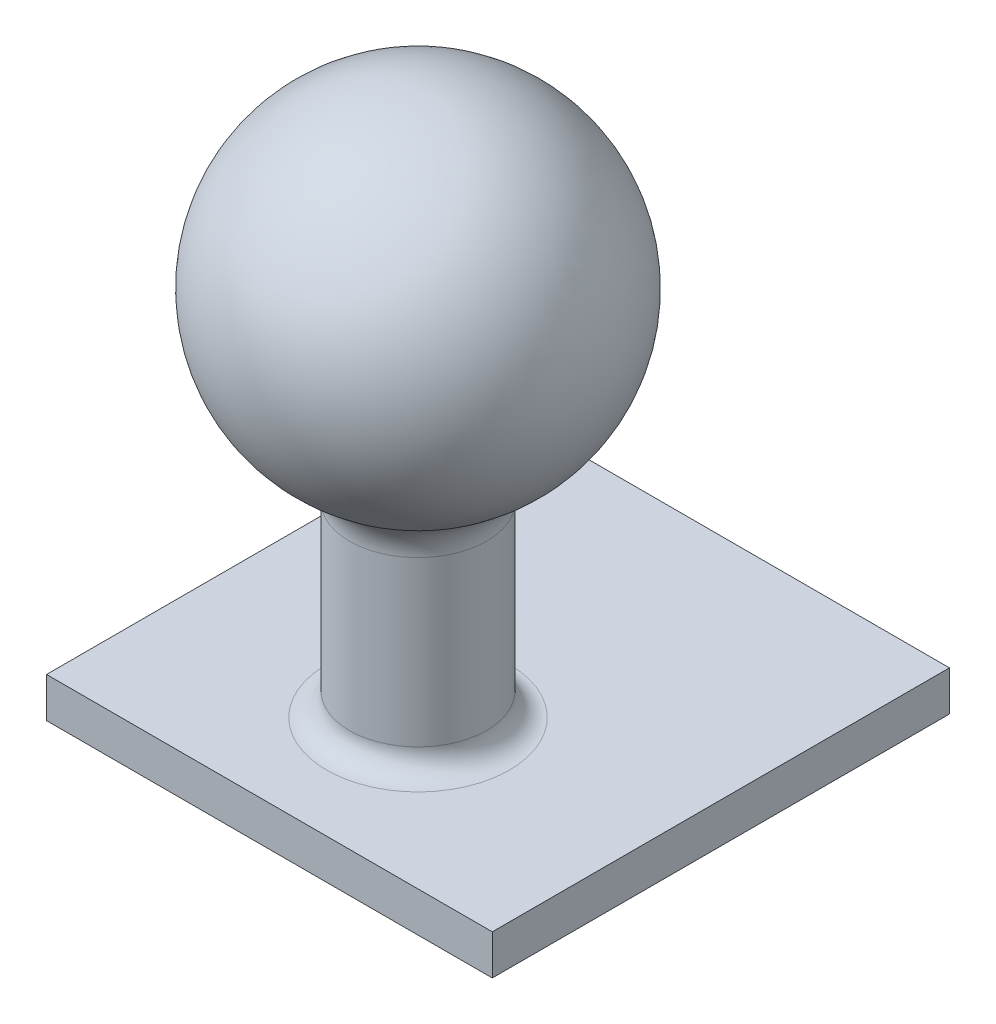
ISO-10303-21;
HEADER;
FILE_DESCRIPTION(('STEP AP214'),'2;1');
FILE_NAME('part.step','',(''),(''),'','','');
FILE_SCHEMA(('AUTOMOTIVE_DESIGN { 1 0 10303 214 1 1 1 1 }'));
ENDSEC;
DATA;
#1=APPLICATION_CONTEXT('core data for automotive mechanical design processes');
#2=APPLICATION_PROTOCOL_DEFINITION('international standard','automotive_design',2000,#1);
#3=PRODUCT_CONTEXT('',#1,'mechanical');
#4=PRODUCT('Part','Part','',(#3));
#5=PRODUCT_RELATED_PRODUCT_CATEGORY('part','',(#4));
#6=PRODUCT_DEFINITION_FORMATION('','',#4);
#7=PRODUCT_DEFINITION_CONTEXT('part definition',#1,'design');
#8=PRODUCT_DEFINITION('design','',#6,#7);
#9=PRODUCT_DEFINITION_SHAPE('','',#8);
#10=(LENGTH_UNIT() NAMED_UNIT(*) SI_UNIT(.MILLI.,.METRE.));
#11=(NAMED_UNIT(*) PLANE_ANGLE_UNIT() SI_UNIT($,.RADIAN.));
#12=(NAMED_UNIT(*) SI_UNIT($,.STERADIAN.) SOLID_ANGLE_UNIT());
#13=UNCERTAINTY_MEASURE_WITH_UNIT(LENGTH_MEASURE(1.E-05),#10,'distance_accuracy_value','');
#14=(GEOMETRIC_REPRESENTATION_CONTEXT(3) GLOBAL_UNCERTAINTY_ASSIGNED_CONTEXT((#13)) GLOBAL_UNIT_ASSIGNED_CONTEXT((#10,
#11,#12)) REPRESENTATION_CONTEXT('',''));
#15=CARTESIAN_POINT('',(0.,0.,0.));
#16=DIRECTION('',(0.,0.,1.));
#17=DIRECTION('',(1.,0.,0.));
#18=AXIS2_PLACEMENT_3D('',#15,#16,#17);
#19=CARTESIAN_POINT('',(0.,0.,0.));
#20=DIRECTION('',(0.,1.,0.));
#21=DIRECTION('',(0.,0.,-1.));
#22=AXIS2_PLACEMENT_3D('',#19,#20,#21);
#23=SPHERICAL_SURFACE('',#22,7.5);
#24=CARTESIAN_POINT('',(0.,-6.37716885055402,0.));
#25=DIRECTION('',(0.,1.,0.));
#26=DIRECTION('',(0.,0.,1.));
#27=AXIS2_PLACEMENT_3D('',#24,#25,#26);
#28=CIRCLE('',#27,3.94736842105263);
#29=CARTESIAN_POINT('',(0.,-6.37716885055402,3.94736842105263));
#30=VERTEX_POINT('',#29);
#31=EDGE_CURVE('E118',#30,#30,#28,.T.);
#32=ORIENTED_EDGE('',*,*,#31,.T.);
#33=EDGE_LOOP('',(#32));
#34=FACE_BOUND('',#33,.T.);
#35=ADVANCED_FACE('F41',(#34),#23,.T.);
#36=CARTESIAN_POINT('',(0.,-16.25,-3.));
#37=DIRECTION('',(0.,-1.,0.));
#38=DIRECTION('',(0.,0.,-1.));
#39=AXIS2_PLACEMENT_3D('',#36,#37,#38);
#40=PLANE('',#39);
#41=CARTESIAN_POINT('',(0.,-16.25,0.));
#42=DIRECTION('',(0.,-1.,0.));
#43=DIRECTION('',(0.,0.,-1.));
#44=AXIS2_PLACEMENT_3D('',#41,#42,#43);
#45=CIRCLE('',#44,4.);
#46=CARTESIAN_POINT('',(0.,-16.25,-4.));
#47=VERTEX_POINT('',#46);
#48=EDGE_CURVE('E11',#47,#47,#45,.T.);
#49=ORIENTED_EDGE('',*,*,#48,.T.);
#50=EDGE_LOOP('',(#49));
#51=FACE_BOUND('',#50,.T.);
#52=DIRECTION('',(0.,0.,1.));
#53=VECTOR('',#52,1.);
#54=CARTESIAN_POINT('',(-9.75,-16.25,-10.));
#55=LINE('',#54,#53);
#56=CARTESIAN_POINT('',(-9.75,-16.25,-13.5));
#57=VERTEX_POINT('',#56);
#58=CARTESIAN_POINT('',(-9.75,-16.25,6.5));
#59=VERTEX_POINT('',#58);
#60=EDGE_CURVE('E95',#57,#59,#55,.T.);
#61=ORIENTED_EDGE('',*,*,#60,.T.);
#62=DIRECTION('',(-1.,0.,0.));
#63=VECTOR('',#62,1.);
#64=CARTESIAN_POINT('',(-9.75,-16.25,6.5));
#65=LINE('',#64,#63);
#66=CARTESIAN_POINT('',(9.75,-16.25,6.5));
#67=VERTEX_POINT('',#66);
#68=EDGE_CURVE('E113',#67,#59,#65,.T.);
#69=ORIENTED_EDGE('',*,*,#68,.F.);
#70=DIRECTION('',(0.,0.,-1.));
#71=VECTOR('',#70,1.);
#72=CARTESIAN_POINT('',(9.75,-16.25,-10.));
#73=LINE('',#72,#71);
#74=CARTESIAN_POINT('',(9.75,-16.25,-13.5));
#75=VERTEX_POINT('',#74);
#76=EDGE_CURVE('E96',#67,#75,#73,.T.);
#77=ORIENTED_EDGE('',*,*,#76,.T.);
#78=DIRECTION('',(1.,0.,0.));
#79=VECTOR('',#78,1.);
#80=CARTESIAN_POINT('',(-9.75,-16.25,-13.5));
#81=LINE('',#80,#79);
#82=EDGE_CURVE('E103',#57,#75,#81,.T.);
#83=ORIENTED_EDGE('',*,*,#82,.F.);
#84=EDGE_LOOP('',(#61,#69,#77,#83));
#85=FACE_BOUND('',#84,.T.);
#86=ADVANCED_FACE('F105',(#51,#85),#40,.F.);
#87=CARTESIAN_POINT('',(0.,0.,0.));
#88=DIRECTION('',(0.,1.,0.));
#89=DIRECTION('',(0.,0.,1.));
#90=AXIS2_PLACEMENT_3D('',#87,#88,#89);
#91=CYLINDRICAL_SURFACE('',#90,3.);
#92=CARTESIAN_POINT('',(0.,-15.25,0.));
#93=DIRECTION('',(0.,-1.,0.));
#94=DIRECTION('',(0.,0.,-1.));
#95=AXIS2_PLACEMENT_3D('',#92,#93,#94);
#96=CIRCLE('',#95,3.);
#97=CARTESIAN_POINT('',(0.,-15.25,-3.));
#98=VERTEX_POINT('',#97);
#99=EDGE_CURVE('E47',#98,#98,#96,.F.);
#100=ORIENTED_EDGE('',*,*,#99,.T.);
#101=EDGE_LOOP('',(#100));
#102=FACE_BOUND('',#101,.T.);
#103=CARTESIAN_POINT('',(0.,-8.07774721070176,0.));
#104=DIRECTION('',(0.,1.,0.));
#105=DIRECTION('',(0.,0.,1.));
#106=AXIS2_PLACEMENT_3D('',#103,#104,#105);
#107=CIRCLE('',#106,3.);
#108=CARTESIAN_POINT('',(0.,-8.07774721070176,3.));
#109=VERTEX_POINT('',#108);
#110=EDGE_CURVE('E121',#109,#109,#107,.F.);
#111=ORIENTED_EDGE('',*,*,#110,.T.);
#112=EDGE_LOOP('',(#111));
#113=FACE_BOUND('',#112,.T.);
#114=ADVANCED_FACE('F126',(#102,#113),#91,.T.);
#115=CARTESIAN_POINT('',(9.75,11.6829554469268,-10.));
#116=DIRECTION('',(1.,0.,0.));
#117=DIRECTION('',(0.,0.,-1.));
#118=AXIS2_PLACEMENT_3D('',#115,#116,#117);
#119=PLANE('',#118);
#120=DIRECTION('',(0.,1.,0.));
#121=VECTOR('',#120,1.);
#122=CARTESIAN_POINT('',(9.75,-18.,6.5));
#123=LINE('',#122,#121);
#124=CARTESIAN_POINT('',(9.75,-18.,6.5));
#125=VERTEX_POINT('',#124);
#126=EDGE_CURVE('E70',#125,#67,#123,.T.);
#127=ORIENTED_EDGE('',*,*,#126,.F.);
#128=DIRECTION('',(0.,0.,1.));
#129=VECTOR('',#128,1.);
#130=CARTESIAN_POINT('',(9.75,-18.,-10.));
#131=LINE('',#130,#129);
#132=CARTESIAN_POINT('',(9.75,-18.,-13.5));
#133=VERTEX_POINT('',#132);
#134=EDGE_CURVE('E85',#133,#125,#131,.T.);
#135=ORIENTED_EDGE('',*,*,#134,.F.);
#136=DIRECTION('',(0.,-1.,0.));
#137=VECTOR('',#136,1.);
#138=CARTESIAN_POINT('',(9.75,-16.25,-13.5));
#139=LINE('',#138,#137);
#140=EDGE_CURVE('E102',#75,#133,#139,.T.);
#141=ORIENTED_EDGE('',*,*,#140,.F.);
#142=ORIENTED_EDGE('',*,*,#76,.F.);
#143=EDGE_LOOP('',(#127,#135,#141,#142));
#144=FACE_BOUND('',#143,.T.);
#145=ADVANCED_FACE('F158',(#144),#119,.T.);
#146=CARTESIAN_POINT('',(-9.75,11.6829554469268,-10.));
#147=DIRECTION('',(-1.,0.,0.));
#148=DIRECTION('',(0.,0.,1.));
#149=AXIS2_PLACEMENT_3D('',#146,#147,#148);
#150=PLANE('',#149);
#151=DIRECTION('',(0.,1.,0.));
#152=VECTOR('',#151,1.);
#153=CARTESIAN_POINT('',(-9.75,-18.,6.5));
#154=LINE('',#153,#152);
#155=CARTESIAN_POINT('',(-9.75,-18.,6.5));
#156=VERTEX_POINT('',#155);
#157=EDGE_CURVE('E57',#156,#59,#154,.T.);
#158=ORIENTED_EDGE('',*,*,#157,.T.);
#159=ORIENTED_EDGE('',*,*,#60,.F.);
#160=DIRECTION('',(0.,1.,0.));
#161=VECTOR('',#160,1.);
#162=CARTESIAN_POINT('',(-9.75,-18.,-13.5));
#163=LINE('',#162,#161);
#164=CARTESIAN_POINT('',(-9.75,-18.,-13.5));
#165=VERTEX_POINT('',#164);
#166=EDGE_CURVE('E98',#165,#57,#163,.T.);
#167=ORIENTED_EDGE('',*,*,#166,.F.);
#168=DIRECTION('',(0.,0.,-1.));
#169=VECTOR('',#168,1.);
#170=CARTESIAN_POINT('',(-9.75,-18.,-10.));
#171=LINE('',#170,#169);
#172=EDGE_CURVE('E74',#156,#165,#171,.T.);
#173=ORIENTED_EDGE('',*,*,#172,.F.);
#174=EDGE_LOOP('',(#158,#159,#167,#173));
#175=FACE_BOUND('',#174,.T.);
#176=ADVANCED_FACE('F92',(#175),#150,.T.);
#177=CARTESIAN_POINT('',(0.,-18.,-6.));
#178=DIRECTION('',(0.,1.,0.));
#179=DIRECTION('',(0.,0.,1.));
#180=AXIS2_PLACEMENT_3D('',#177,#178,#179);
#181=PLANE('',#180);
#182=ORIENTED_EDGE('',*,*,#134,.T.);
#183=DIRECTION('',(-1.,0.,0.));
#184=VECTOR('',#183,1.);
#185=CARTESIAN_POINT('',(-9.75,-18.,6.5));
#186=LINE('',#185,#184);
#187=EDGE_CURVE('E62',#125,#156,#186,.T.);
#188=ORIENTED_EDGE('',*,*,#187,.T.);
#189=ORIENTED_EDGE('',*,*,#172,.T.);
#190=DIRECTION('',(-1.,0.,0.));
#191=VECTOR('',#190,1.);
#192=CARTESIAN_POINT('',(9.75,-18.,-13.5));
#193=LINE('',#192,#191);
#194=EDGE_CURVE('E108',#133,#165,#193,.T.);
#195=ORIENTED_EDGE('',*,*,#194,.F.);
#196=EDGE_LOOP('',(#182,#188,#189,#195));
#197=FACE_BOUND('',#196,.T.);
#198=ADVANCED_FACE('F152',(#197),#181,.F.);
#199=CARTESIAN_POINT('',(-9.75,-18.,6.5));
#200=DIRECTION('',(0.,0.,-1.));
#201=DIRECTION('',(0.,1.,0.));
#202=AXIS2_PLACEMENT_3D('',#199,#200,#201);
#203=PLANE('',#202);
#204=ORIENTED_EDGE('',*,*,#68,.T.);
#205=ORIENTED_EDGE('',*,*,#157,.F.);
#206=ORIENTED_EDGE('',*,*,#187,.F.);
#207=ORIENTED_EDGE('',*,*,#126,.T.);
#208=EDGE_LOOP('',(#204,#205,#206,#207));
#209=FACE_BOUND('',#208,.T.);
#210=ADVANCED_FACE('F155',(#209),#203,.F.);
#211=CARTESIAN_POINT('',(0.,0.,-13.5));
#212=DIRECTION('',(0.,0.,-1.));
#213=DIRECTION('',(-1.,0.,0.));
#214=AXIS2_PLACEMENT_3D('',#211,#212,#213);
#215=PLANE('',#214);
#216=ORIENTED_EDGE('',*,*,#166,.T.);
#217=ORIENTED_EDGE('',*,*,#82,.T.);
#218=ORIENTED_EDGE('',*,*,#140,.T.);
#219=ORIENTED_EDGE('',*,*,#194,.T.);
#220=EDGE_LOOP('',(#216,#217,#218,#219));
#221=FACE_BOUND('',#220,.T.);
#222=ADVANCED_FACE('F110',(#221),#215,.T.);
#223=CARTESIAN_POINT('',(0.,-8.07774721070176,0.));
#224=DIRECTION('',(0.,1.,0.));
#225=DIRECTION('',(0.,0.,1.));
#226=AXIS2_PLACEMENT_3D('',#223,#224,#225);
#227=TOROIDAL_SURFACE('',#226,5.,2.);
#228=ORIENTED_EDGE('',*,*,#110,.F.);
#229=EDGE_LOOP('',(#228));
#230=FACE_BOUND('',#229,.T.);
#231=ORIENTED_EDGE('',*,*,#31,.F.);
#232=EDGE_LOOP('',(#231));
#233=FACE_BOUND('',#232,.T.);
#234=ADVANCED_FACE('F135',(#230,#233),#227,.F.);
#235=CARTESIAN_POINT('',(0.,-15.25,0.));
#236=DIRECTION('',(0.,-1.,0.));
#237=DIRECTION('',(0.,0.,-1.));
#238=AXIS2_PLACEMENT_3D('',#235,#236,#237);
#239=TOROIDAL_SURFACE('',#238,4.,1.);
#240=ORIENTED_EDGE('',*,*,#48,.F.);
#241=EDGE_LOOP('',(#240));
#242=FACE_BOUND('',#241,.T.);
#243=ORIENTED_EDGE('',*,*,#99,.F.);
#244=EDGE_LOOP('',(#243));
#245=FACE_BOUND('',#244,.T.);
#246=ADVANCED_FACE('F43',(#242,#245),#239,.F.);
#247=CLOSED_SHELL('',(#35,#86,#114,#145,#176,#198,#210,#222,#234,#246));
#248=MANIFOLD_SOLID_BREP('B2',#247);
#249=ADVANCED_BREP_SHAPE_REPRESENTATION('',(#18,#248),#14);
#250=SHAPE_DEFINITION_REPRESENTATION(#9,#249);
ENDSEC;
END-ISO-10303-21;
